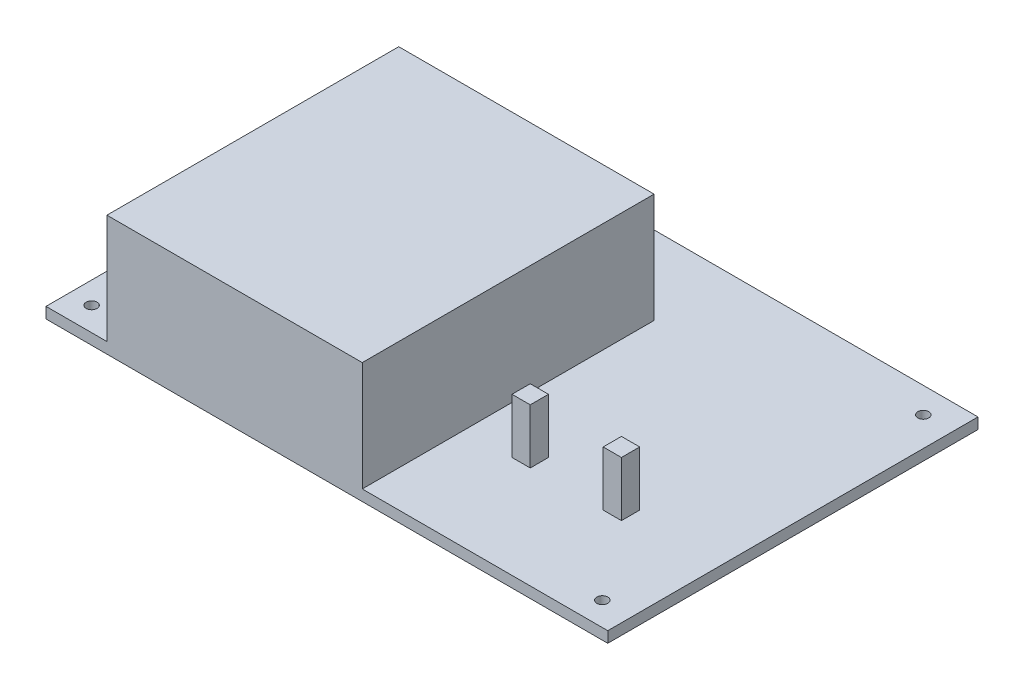
ISO-10303-21;
HEADER;
FILE_DESCRIPTION(('STEP AP214'),'2;1');
FILE_NAME('part.step','',(''),(''),'','','');
FILE_SCHEMA(('AUTOMOTIVE_DESIGN { 1 0 10303 214 1 1 1 1 }'));
ENDSEC;
DATA;
#1=APPLICATION_CONTEXT('core data for automotive mechanical design processes');
#2=APPLICATION_PROTOCOL_DEFINITION('international standard','automotive_design',2000,#1);
#3=PRODUCT_CONTEXT('',#1,'mechanical');
#4=PRODUCT('Part','Part','',(#3));
#5=PRODUCT_RELATED_PRODUCT_CATEGORY('part','',(#4));
#6=PRODUCT_DEFINITION_FORMATION('','',#4);
#7=PRODUCT_DEFINITION_CONTEXT('part definition',#1,'design');
#8=PRODUCT_DEFINITION('design','',#6,#7);
#9=PRODUCT_DEFINITION_SHAPE('','',#8);
#10=(LENGTH_UNIT() NAMED_UNIT(*) SI_UNIT(.MILLI.,.METRE.));
#11=(NAMED_UNIT(*) PLANE_ANGLE_UNIT() SI_UNIT($,.RADIAN.));
#12=(NAMED_UNIT(*) SI_UNIT($,.STERADIAN.) SOLID_ANGLE_UNIT());
#13=UNCERTAINTY_MEASURE_WITH_UNIT(LENGTH_MEASURE(1.E-05),#10,'distance_accuracy_value','');
#14=(GEOMETRIC_REPRESENTATION_CONTEXT(3) GLOBAL_UNCERTAINTY_ASSIGNED_CONTEXT((#13)) GLOBAL_UNIT_ASSIGNED_CONTEXT((#10,
#11,#12)) REPRESENTATION_CONTEXT('',''));
#15=CARTESIAN_POINT('',(0.,0.,0.));
#16=DIRECTION('',(0.,0.,1.));
#17=DIRECTION('',(1.,0.,0.));
#18=AXIS2_PLACEMENT_3D('',#15,#16,#17);
#19=CARTESIAN_POINT('',(0.,3.,0.));
#20=DIRECTION('',(0.,-1.,0.));
#21=DIRECTION('',(0.,0.,-1.));
#22=AXIS2_PLACEMENT_3D('',#19,#20,#21);
#23=PLANE('',#22);
#24=DIRECTION('',(0.,0.,-1.));
#25=VECTOR('',#24,1.);
#26=CARTESIAN_POINT('',(27.7499999999996,3.,22.7500000000001));
#27=LINE('',#26,#25);
#28=CARTESIAN_POINT('',(27.7499999999996,3.,22.7500000000001));
#29=VERTEX_POINT('',#28);
#30=CARTESIAN_POINT('',(27.7499999999996,3.,17.7500000000001));
#31=VERTEX_POINT('',#30);
#32=EDGE_CURVE('E169',#29,#31,#27,.T.);
#33=ORIENTED_EDGE('',*,*,#32,.F.);
#34=DIRECTION('',(1.,0.,0.));
#35=VECTOR('',#34,1.);
#36=CARTESIAN_POINT('',(22.7499999999996,3.,22.7500000000001));
#37=LINE('',#36,#35);
#38=CARTESIAN_POINT('',(22.7499999999996,3.,22.7500000000001));
#39=VERTEX_POINT('',#38);
#40=EDGE_CURVE('E182',#39,#29,#37,.T.);
#41=ORIENTED_EDGE('',*,*,#40,.F.);
#42=DIRECTION('',(0.,0.,1.));
#43=VECTOR('',#42,1.);
#44=CARTESIAN_POINT('',(22.7499999999996,3.,22.7500000000001));
#45=LINE('',#44,#43);
#46=CARTESIAN_POINT('',(22.7499999999996,3.,17.7500000000001));
#47=VERTEX_POINT('',#46);
#48=EDGE_CURVE('E191',#47,#39,#45,.T.);
#49=ORIENTED_EDGE('',*,*,#48,.F.);
#50=DIRECTION('',(-1.,0.,0.));
#51=VECTOR('',#50,1.);
#52=CARTESIAN_POINT('',(22.7499999999996,3.,17.7500000000001));
#53=LINE('',#52,#51);
#54=EDGE_CURVE('E172',#31,#47,#53,.T.);
#55=ORIENTED_EDGE('',*,*,#54,.F.);
#56=EDGE_LOOP('',(#33,#41,#49,#55));
#57=FACE_BOUND('',#56,.T.);
#58=CARTESIAN_POINT('',(-71.0000000000004,3.,-43.7499999999996));
#59=DIRECTION('',(0.,1.,0.));
#60=DIRECTION('',(0.,0.,1.));
#61=AXIS2_PLACEMENT_3D('',#58,#59,#60);
#62=CIRCLE('',#61,1.5);
#63=CARTESIAN_POINT('',(-71.0000000000004,3.,-42.2499999999996));
#64=VERTEX_POINT('',#63);
#65=EDGE_CURVE('E247',#64,#64,#62,.T.);
#66=ORIENTED_EDGE('',*,*,#65,.F.);
#67=EDGE_LOOP('',(#66));
#68=FACE_BOUND('',#67,.T.);
#69=CARTESIAN_POINT('',(68.9999999999996,3.,44.2500000000004));
#70=DIRECTION('',(0.,1.,0.));
#71=DIRECTION('',(0.,0.,1.));
#72=AXIS2_PLACEMENT_3D('',#69,#70,#71);
#73=CIRCLE('',#72,1.5);
#74=CARTESIAN_POINT('',(68.9999999999996,3.,45.7500000000004));
#75=VERTEX_POINT('',#74);
#76=EDGE_CURVE('E237',#75,#75,#73,.T.);
#77=ORIENTED_EDGE('',*,*,#76,.F.);
#78=EDGE_LOOP('',(#77));
#79=FACE_BOUND('',#78,.T.);
#80=CARTESIAN_POINT('',(-71.0000000000004,3.,44.2500000000004));
#81=DIRECTION('',(0.,1.,0.));
#82=DIRECTION('',(0.,0.,1.));
#83=AXIS2_PLACEMENT_3D('',#80,#81,#82);
#84=CIRCLE('',#83,1.5);
#85=CARTESIAN_POINT('',(-71.0000000000004,3.,45.7500000000004));
#86=VERTEX_POINT('',#85);
#87=EDGE_CURVE('E241',#86,#86,#84,.T.);
#88=ORIENTED_EDGE('',*,*,#87,.F.);
#89=EDGE_LOOP('',(#88));
#90=FACE_BOUND('',#89,.T.);
#91=CARTESIAN_POINT('',(68.9999999999996,3.,-43.7499999999996));
#92=DIRECTION('',(0.,1.,0.));
#93=DIRECTION('',(0.,0.,1.));
#94=AXIS2_PLACEMENT_3D('',#91,#92,#93);
#95=CIRCLE('',#94,1.5);
#96=CARTESIAN_POINT('',(68.9999999999996,3.,-42.2499999999996));
#97=VERTEX_POINT('',#96);
#98=EDGE_CURVE('E248',#97,#97,#95,.T.);
#99=ORIENTED_EDGE('',*,*,#98,.F.);
#100=EDGE_LOOP('',(#99));
#101=FACE_BOUND('',#100,.T.);
#102=DIRECTION('',(0.,0.,-1.));
#103=VECTOR('',#102,1.);
#104=CARTESIAN_POINT('',(9.69999999999963,3.,50.7500000000004));
#105=LINE('',#104,#103);
#106=CARTESIAN_POINT('',(9.69999999999963,3.,50.7500000000001));
#107=VERTEX_POINT('',#106);
#108=CARTESIAN_POINT('',(9.69999999999963,3.,-29.2499999999996));
#109=VERTEX_POINT('',#108);
#110=EDGE_CURVE('E207',#107,#109,#105,.T.);
#111=ORIENTED_EDGE('',*,*,#110,.F.);
#112=DIRECTION('',(1.,0.,0.));
#113=VECTOR('',#112,1.);
#114=CARTESIAN_POINT('',(-77.0000000000004,3.,50.7500000000001));
#115=LINE('',#114,#113);
#116=CARTESIAN_POINT('',(76.9999999999996,3.,50.7500000000001));
#117=VERTEX_POINT('',#116);
#118=EDGE_CURVE('E270',#107,#117,#115,.T.);
#119=ORIENTED_EDGE('',*,*,#118,.T.);
#120=DIRECTION('',(0.,0.,-1.));
#121=VECTOR('',#120,1.);
#122=CARTESIAN_POINT('',(76.9999999999996,3.,50.7500000000001));
#123=LINE('',#122,#121);
#124=CARTESIAN_POINT('',(76.9999999999996,3.,-50.7499999999996));
#125=VERTEX_POINT('',#124);
#126=EDGE_CURVE('E262',#117,#125,#123,.T.);
#127=ORIENTED_EDGE('',*,*,#126,.T.);
#128=DIRECTION('',(-1.,0.,0.));
#129=VECTOR('',#128,1.);
#130=CARTESIAN_POINT('',(-77.0000000000004,3.,-50.7499999999996));
#131=LINE('',#130,#129);
#132=CARTESIAN_POINT('',(-77.0000000000004,3.,-50.7499999999996));
#133=VERTEX_POINT('',#132);
#134=EDGE_CURVE('E265',#125,#133,#131,.T.);
#135=ORIENTED_EDGE('',*,*,#134,.T.);
#136=DIRECTION('',(0.,0.,1.));
#137=VECTOR('',#136,1.);
#138=CARTESIAN_POINT('',(-77.0000000000004,3.,50.7500000000001));
#139=LINE('',#138,#137);
#140=CARTESIAN_POINT('',(-77.0000000000004,3.,50.7500000000001));
#141=VERTEX_POINT('',#140);
#142=EDGE_CURVE('E268',#133,#141,#139,.T.);
#143=ORIENTED_EDGE('',*,*,#142,.T.);
#144=CARTESIAN_POINT('',(-60.3000000000004,3.,50.7500000000001));
#145=VERTEX_POINT('',#144);
#146=EDGE_CURVE('E271',#141,#145,#115,.T.);
#147=ORIENTED_EDGE('',*,*,#146,.T.);
#148=DIRECTION('',(0.,0.,1.));
#149=VECTOR('',#148,1.);
#150=CARTESIAN_POINT('',(-60.3000000000004,3.,50.7500000000004));
#151=LINE('',#150,#149);
#152=CARTESIAN_POINT('',(-60.3000000000004,3.,-29.2499999999996));
#153=VERTEX_POINT('',#152);
#154=EDGE_CURVE('E212',#153,#145,#151,.T.);
#155=ORIENTED_EDGE('',*,*,#154,.F.);
#156=DIRECTION('',(-1.,0.,0.));
#157=VECTOR('',#156,1.);
#158=CARTESIAN_POINT('',(-60.3000000000004,3.,-29.2499999999996));
#159=LINE('',#158,#157);
#160=EDGE_CURVE('E221',#109,#153,#159,.T.);
#161=ORIENTED_EDGE('',*,*,#160,.F.);
#162=EDGE_LOOP('',(#111,#119,#127,#135,#143,#147,#155,#161));
#163=FACE_BOUND('',#162,.T.);
#164=DIRECTION('',(0.,0.,-1.));
#165=VECTOR('',#164,1.);
#166=CARTESIAN_POINT('',(52.7499999999996,3.,22.7500000000001));
#167=LINE('',#166,#165);
#168=CARTESIAN_POINT('',(52.7499999999996,3.,22.7500000000001));
#169=VERTEX_POINT('',#168);
#170=CARTESIAN_POINT('',(52.7499999999996,3.,17.7500000000001));
#171=VERTEX_POINT('',#170);
#172=EDGE_CURVE('E168',#169,#171,#167,.T.);
#173=ORIENTED_EDGE('',*,*,#172,.F.);
#174=DIRECTION('',(1.,0.,0.));
#175=VECTOR('',#174,1.);
#176=CARTESIAN_POINT('',(47.7499999999996,3.,22.7500000000001));
#177=LINE('',#176,#175);
#178=CARTESIAN_POINT('',(47.7499999999996,3.,22.7500000000001));
#179=VERTEX_POINT('',#178);
#180=EDGE_CURVE('E165',#179,#169,#177,.T.);
#181=ORIENTED_EDGE('',*,*,#180,.F.);
#182=DIRECTION('',(0.,0.,1.));
#183=VECTOR('',#182,1.);
#184=CARTESIAN_POINT('',(47.7499999999996,3.,22.7500000000001));
#185=LINE('',#184,#183);
#186=CARTESIAN_POINT('',(47.7499999999996,3.,17.7500000000001));
#187=VERTEX_POINT('',#186);
#188=EDGE_CURVE('E55',#187,#179,#185,.T.);
#189=ORIENTED_EDGE('',*,*,#188,.F.);
#190=DIRECTION('',(-1.,0.,0.));
#191=VECTOR('',#190,1.);
#192=CARTESIAN_POINT('',(47.7499999999996,3.,17.7500000000001));
#193=LINE('',#192,#191);
#194=EDGE_CURVE('E50',#171,#187,#193,.T.);
#195=ORIENTED_EDGE('',*,*,#194,.F.);
#196=EDGE_LOOP('',(#173,#181,#189,#195));
#197=FACE_BOUND('',#196,.T.);
#198=ADVANCED_FACE('F35',(#57,#68,#79,#90,#101,#163,#197),#23,.F.);
#199=CARTESIAN_POINT('',(76.9999999999996,3.,50.7500000000001));
#200=DIRECTION('',(-1.,0.,0.));
#201=DIRECTION('',(0.,0.,1.));
#202=AXIS2_PLACEMENT_3D('',#199,#200,#201);
#203=PLANE('',#202);
#204=DIRECTION('',(0.,0.,-1.));
#205=VECTOR('',#204,1.);
#206=CARTESIAN_POINT('',(76.9999999999996,0.,50.7500000000001));
#207=LINE('',#206,#205);
#208=CARTESIAN_POINT('',(76.9999999999996,0.,50.7500000000001));
#209=VERTEX_POINT('',#208);
#210=CARTESIAN_POINT('',(76.9999999999996,0.,-50.7499999999996));
#211=VERTEX_POINT('',#210);
#212=EDGE_CURVE('E259',#209,#211,#207,.T.);
#213=ORIENTED_EDGE('',*,*,#212,.T.);
#214=DIRECTION('',(0.,-1.,0.));
#215=VECTOR('',#214,1.);
#216=CARTESIAN_POINT('',(76.9999999999996,3.,-50.7499999999996));
#217=LINE('',#216,#215);
#218=EDGE_CURVE('E11',#125,#211,#217,.T.);
#219=ORIENTED_EDGE('',*,*,#218,.F.);
#220=ORIENTED_EDGE('',*,*,#126,.F.);
#221=DIRECTION('',(0.,-1.,0.));
#222=VECTOR('',#221,1.);
#223=CARTESIAN_POINT('',(76.9999999999996,3.,50.7500000000001));
#224=LINE('',#223,#222);
#225=EDGE_CURVE('E273',#117,#209,#224,.T.);
#226=ORIENTED_EDGE('',*,*,#225,.T.);
#227=EDGE_LOOP('',(#213,#219,#220,#226));
#228=FACE_BOUND('',#227,.T.);
#229=ADVANCED_FACE('F37',(#228),#203,.F.);
#230=CARTESIAN_POINT('',(-77.0000000000004,3.,-50.7499999999996));
#231=DIRECTION('',(0.,0.,1.));
#232=DIRECTION('',(1.,0.,0.));
#233=AXIS2_PLACEMENT_3D('',#230,#231,#232);
#234=PLANE('',#233);
#235=DIRECTION('',(-1.,0.,0.));
#236=VECTOR('',#235,1.);
#237=CARTESIAN_POINT('',(-77.0000000000004,0.,-50.7499999999996));
#238=LINE('',#237,#236);
#239=CARTESIAN_POINT('',(-77.0000000000004,0.,-50.7499999999996));
#240=VERTEX_POINT('',#239);
#241=EDGE_CURVE('E276',#211,#240,#238,.T.);
#242=ORIENTED_EDGE('',*,*,#241,.T.);
#243=DIRECTION('',(0.,-1.,0.));
#244=VECTOR('',#243,1.);
#245=CARTESIAN_POINT('',(-77.0000000000004,3.,-50.7499999999996));
#246=LINE('',#245,#244);
#247=EDGE_CURVE('E43',#133,#240,#246,.T.);
#248=ORIENTED_EDGE('',*,*,#247,.F.);
#249=ORIENTED_EDGE('',*,*,#134,.F.);
#250=ORIENTED_EDGE('',*,*,#218,.T.);
#251=EDGE_LOOP('',(#242,#248,#249,#250));
#252=FACE_BOUND('',#251,.T.);
#253=ADVANCED_FACE('F336',(#252),#234,.F.);
#254=CARTESIAN_POINT('',(-77.0000000000004,3.,50.7500000000001));
#255=DIRECTION('',(1.,0.,0.));
#256=DIRECTION('',(0.,0.,-1.));
#257=AXIS2_PLACEMENT_3D('',#254,#255,#256);
#258=PLANE('',#257);
#259=DIRECTION('',(0.,0.,1.));
#260=VECTOR('',#259,1.);
#261=CARTESIAN_POINT('',(-77.0000000000004,0.,50.7500000000001));
#262=LINE('',#261,#260);
#263=CARTESIAN_POINT('',(-77.0000000000004,0.,50.7500000000001));
#264=VERTEX_POINT('',#263);
#265=EDGE_CURVE('E278',#240,#264,#262,.T.);
#266=ORIENTED_EDGE('',*,*,#265,.T.);
#267=DIRECTION('',(0.,-1.,0.));
#268=VECTOR('',#267,1.);
#269=CARTESIAN_POINT('',(-77.0000000000004,3.,50.7500000000001));
#270=LINE('',#269,#268);
#271=EDGE_CURVE('E283',#141,#264,#270,.T.);
#272=ORIENTED_EDGE('',*,*,#271,.F.);
#273=ORIENTED_EDGE('',*,*,#142,.F.);
#274=ORIENTED_EDGE('',*,*,#247,.T.);
#275=EDGE_LOOP('',(#266,#272,#273,#274));
#276=FACE_BOUND('',#275,.T.);
#277=ADVANCED_FACE('F290',(#276),#258,.F.);
#278=CARTESIAN_POINT('',(-77.0000000000004,3.,50.7500000000001));
#279=DIRECTION('',(0.,0.,-1.));
#280=DIRECTION('',(-1.,0.,0.));
#281=AXIS2_PLACEMENT_3D('',#278,#279,#280);
#282=PLANE('',#281);
#283=DIRECTION('',(1.,0.,0.));
#284=VECTOR('',#283,1.);
#285=CARTESIAN_POINT('',(-77.0000000000004,0.,50.7500000000001));
#286=LINE('',#285,#284);
#287=EDGE_CURVE('E266',#264,#209,#286,.T.);
#288=ORIENTED_EDGE('',*,*,#287,.T.);
#289=ORIENTED_EDGE('',*,*,#225,.F.);
#290=ORIENTED_EDGE('',*,*,#118,.F.);
#291=DIRECTION('',(0.,-1.,0.));
#292=VECTOR('',#291,1.);
#293=CARTESIAN_POINT('',(9.69999999999963,33.,50.7500000000004));
#294=LINE('',#293,#292);
#295=CARTESIAN_POINT('',(9.69999999999963,33.,50.7500000000004));
#296=VERTEX_POINT('',#295);
#297=EDGE_CURVE('E218',#296,#107,#294,.T.);
#298=ORIENTED_EDGE('',*,*,#297,.F.);
#299=DIRECTION('',(1.,0.,0.));
#300=VECTOR('',#299,1.);
#301=CARTESIAN_POINT('',(-60.3000000000004,33.,50.7500000000004));
#302=LINE('',#301,#300);
#303=CARTESIAN_POINT('',(-60.3000000000004,33.,50.7500000000004));
#304=VERTEX_POINT('',#303);
#305=EDGE_CURVE('E216',#304,#296,#302,.T.);
#306=ORIENTED_EDGE('',*,*,#305,.F.);
#307=DIRECTION('',(0.,-1.,0.));
#308=VECTOR('',#307,1.);
#309=CARTESIAN_POINT('',(-60.3000000000004,33.,50.7500000000004));
#310=LINE('',#309,#308);
#311=EDGE_CURVE('E228',#304,#145,#310,.T.);
#312=ORIENTED_EDGE('',*,*,#311,.T.);
#313=ORIENTED_EDGE('',*,*,#146,.F.);
#314=ORIENTED_EDGE('',*,*,#271,.T.);
#315=EDGE_LOOP('',(#288,#289,#290,#298,#306,#312,#313,#314));
#316=FACE_BOUND('',#315,.T.);
#317=ADVANCED_FACE('F299',(#316),#282,.F.);
#318=CARTESIAN_POINT('',(0.,0.,0.));
#319=DIRECTION('',(0.,-1.,0.));
#320=DIRECTION('',(0.,0.,-1.));
#321=AXIS2_PLACEMENT_3D('',#318,#319,#320);
#322=PLANE('',#321);
#323=CARTESIAN_POINT('',(-3.7470027081099E-13,0.,2.22044604925031E-13));
#324=DIRECTION('',(0.,-1.,0.));
#325=DIRECTION('',(0.,0.,-1.));
#326=AXIS2_PLACEMENT_3D('',#323,#324,#325);
#327=CIRCLE('',#326,5.);
#328=CARTESIAN_POINT('',(-3.7470027081099E-13,0.,-4.99999999999978));
#329=VERTEX_POINT('',#328);
#330=EDGE_CURVE('E572',#329,#329,#327,.T.);
#331=ORIENTED_EDGE('',*,*,#330,.F.);
#332=EDGE_LOOP('',(#331));
#333=FACE_BOUND('',#332,.T.);
#334=CARTESIAN_POINT('',(68.9999999999996,0.,-43.7499999999996));
#335=DIRECTION('',(0.,1.,0.));
#336=DIRECTION('',(0.,0.,1.));
#337=AXIS2_PLACEMENT_3D('',#334,#335,#336);
#338=CIRCLE('',#337,1.5);
#339=CARTESIAN_POINT('',(68.9999999999996,0.,-42.2499999999996));
#340=VERTEX_POINT('',#339);
#341=EDGE_CURVE('E244',#340,#340,#338,.T.);
#342=ORIENTED_EDGE('',*,*,#341,.T.);
#343=EDGE_LOOP('',(#342));
#344=FACE_BOUND('',#343,.T.);
#345=CARTESIAN_POINT('',(-71.0000000000004,0.,44.2500000000004));
#346=DIRECTION('',(0.,1.,0.));
#347=DIRECTION('',(0.,0.,1.));
#348=AXIS2_PLACEMENT_3D('',#345,#346,#347);
#349=CIRCLE('',#348,1.5);
#350=CARTESIAN_POINT('',(-71.0000000000004,0.,45.7500000000004));
#351=VERTEX_POINT('',#350);
#352=EDGE_CURVE('E251',#351,#351,#349,.T.);
#353=ORIENTED_EDGE('',*,*,#352,.T.);
#354=EDGE_LOOP('',(#353));
#355=FACE_BOUND('',#354,.T.);
#356=CARTESIAN_POINT('',(68.9999999999996,0.,44.2500000000004));
#357=DIRECTION('',(0.,1.,0.));
#358=DIRECTION('',(0.,0.,1.));
#359=AXIS2_PLACEMENT_3D('',#356,#357,#358);
#360=CIRCLE('',#359,1.5);
#361=CARTESIAN_POINT('',(68.9999999999996,0.,45.7500000000004));
#362=VERTEX_POINT('',#361);
#363=EDGE_CURVE('E238',#362,#362,#360,.T.);
#364=ORIENTED_EDGE('',*,*,#363,.T.);
#365=EDGE_LOOP('',(#364));
#366=FACE_BOUND('',#365,.T.);
#367=CARTESIAN_POINT('',(-71.0000000000004,0.,-43.7499999999996));
#368=DIRECTION('',(0.,1.,0.));
#369=DIRECTION('',(0.,0.,1.));
#370=AXIS2_PLACEMENT_3D('',#367,#368,#369);
#371=CIRCLE('',#370,1.5);
#372=CARTESIAN_POINT('',(-71.0000000000004,0.,-42.2499999999996));
#373=VERTEX_POINT('',#372);
#374=EDGE_CURVE('E256',#373,#373,#371,.T.);
#375=ORIENTED_EDGE('',*,*,#374,.T.);
#376=EDGE_LOOP('',(#375));
#377=FACE_BOUND('',#376,.T.);
#378=ORIENTED_EDGE('',*,*,#212,.F.);
#379=ORIENTED_EDGE('',*,*,#287,.F.);
#380=ORIENTED_EDGE('',*,*,#265,.F.);
#381=ORIENTED_EDGE('',*,*,#241,.F.);
#382=EDGE_LOOP('',(#378,#379,#380,#381));
#383=FACE_BOUND('',#382,.T.);
#384=ADVANCED_FACE('F296',(#333,#344,#355,#366,#377,#383),#322,.T.);
#385=CARTESIAN_POINT('',(-71.0000000000004,0.,-43.7499999999996));
#386=DIRECTION('',(0.,1.,0.));
#387=DIRECTION('',(0.,0.,1.));
#388=AXIS2_PLACEMENT_3D('',#385,#386,#387);
#389=CYLINDRICAL_SURFACE('',#388,1.5);
#390=ORIENTED_EDGE('',*,*,#374,.F.);
#391=EDGE_LOOP('',(#390));
#392=FACE_BOUND('',#391,.T.);
#393=ORIENTED_EDGE('',*,*,#65,.T.);
#394=EDGE_LOOP('',(#393));
#395=FACE_BOUND('',#394,.T.);
#396=ADVANCED_FACE('F340',(#392,#395),#389,.F.);
#397=CARTESIAN_POINT('',(68.9999999999996,0.,44.2500000000004));
#398=DIRECTION('',(0.,1.,0.));
#399=DIRECTION('',(0.,0.,1.));
#400=AXIS2_PLACEMENT_3D('',#397,#398,#399);
#401=CYLINDRICAL_SURFACE('',#400,1.5);
#402=ORIENTED_EDGE('',*,*,#363,.F.);
#403=EDGE_LOOP('',(#402));
#404=FACE_BOUND('',#403,.T.);
#405=ORIENTED_EDGE('',*,*,#76,.T.);
#406=EDGE_LOOP('',(#405));
#407=FACE_BOUND('',#406,.T.);
#408=ADVANCED_FACE('F379',(#404,#407),#401,.F.);
#409=CARTESIAN_POINT('',(-71.0000000000004,0.,44.2500000000004));
#410=DIRECTION('',(0.,1.,0.));
#411=DIRECTION('',(0.,0.,1.));
#412=AXIS2_PLACEMENT_3D('',#409,#410,#411);
#413=CYLINDRICAL_SURFACE('',#412,1.5);
#414=ORIENTED_EDGE('',*,*,#352,.F.);
#415=EDGE_LOOP('',(#414));
#416=FACE_BOUND('',#415,.T.);
#417=ORIENTED_EDGE('',*,*,#87,.T.);
#418=EDGE_LOOP('',(#417));
#419=FACE_BOUND('',#418,.T.);
#420=ADVANCED_FACE('F387',(#416,#419),#413,.F.);
#421=CARTESIAN_POINT('',(68.9999999999996,0.,-43.7499999999996));
#422=DIRECTION('',(0.,1.,0.));
#423=DIRECTION('',(0.,0.,1.));
#424=AXIS2_PLACEMENT_3D('',#421,#422,#423);
#425=CYLINDRICAL_SURFACE('',#424,1.5);
#426=ORIENTED_EDGE('',*,*,#341,.F.);
#427=EDGE_LOOP('',(#426));
#428=FACE_BOUND('',#427,.T.);
#429=ORIENTED_EDGE('',*,*,#98,.T.);
#430=EDGE_LOOP('',(#429));
#431=FACE_BOUND('',#430,.T.);
#432=ADVANCED_FACE('F328',(#428,#431),#425,.F.);
#433=CARTESIAN_POINT('',(9.69999999999963,33.,50.7500000000004));
#434=DIRECTION('',(-1.,0.,0.));
#435=DIRECTION('',(0.,0.,1.));
#436=AXIS2_PLACEMENT_3D('',#433,#434,#435);
#437=PLANE('',#436);
#438=ORIENTED_EDGE('',*,*,#110,.T.);
#439=DIRECTION('',(0.,-1.,0.));
#440=VECTOR('',#439,1.);
#441=CARTESIAN_POINT('',(9.69999999999963,33.,-29.2499999999996));
#442=LINE('',#441,#440);
#443=CARTESIAN_POINT('',(9.69999999999963,33.,-29.2499999999996));
#444=VERTEX_POINT('',#443);
#445=EDGE_CURVE('E234',#444,#109,#442,.T.);
#446=ORIENTED_EDGE('',*,*,#445,.F.);
#447=DIRECTION('',(0.,0.,-1.));
#448=VECTOR('',#447,1.);
#449=CARTESIAN_POINT('',(9.69999999999963,33.,50.7500000000004));
#450=LINE('',#449,#448);
#451=EDGE_CURVE('E208',#296,#444,#450,.T.);
#452=ORIENTED_EDGE('',*,*,#451,.F.);
#453=ORIENTED_EDGE('',*,*,#297,.T.);
#454=EDGE_LOOP('',(#438,#446,#452,#453));
#455=FACE_BOUND('',#454,.T.);
#456=ADVANCED_FACE('F310',(#455),#437,.F.);
#457=CARTESIAN_POINT('',(-60.3000000000004,33.,-29.2499999999996));
#458=DIRECTION('',(0.,0.,1.));
#459=DIRECTION('',(1.,0.,0.));
#460=AXIS2_PLACEMENT_3D('',#457,#458,#459);
#461=PLANE('',#460);
#462=ORIENTED_EDGE('',*,*,#160,.T.);
#463=DIRECTION('',(0.,-1.,0.));
#464=VECTOR('',#463,1.);
#465=CARTESIAN_POINT('',(-60.3000000000004,33.,-29.2499999999996));
#466=LINE('',#465,#464);
#467=CARTESIAN_POINT('',(-60.3000000000004,33.,-29.2499999999996));
#468=VERTEX_POINT('',#467);
#469=EDGE_CURVE('E231',#468,#153,#466,.T.);
#470=ORIENTED_EDGE('',*,*,#469,.F.);
#471=DIRECTION('',(-1.,0.,0.));
#472=VECTOR('',#471,1.);
#473=CARTESIAN_POINT('',(-60.3000000000004,33.,-29.2499999999996));
#474=LINE('',#473,#472);
#475=EDGE_CURVE('E211',#444,#468,#474,.T.);
#476=ORIENTED_EDGE('',*,*,#475,.F.);
#477=ORIENTED_EDGE('',*,*,#445,.T.);
#478=EDGE_LOOP('',(#462,#470,#476,#477));
#479=FACE_BOUND('',#478,.T.);
#480=ADVANCED_FACE('F320',(#479),#461,.F.);
#481=CARTESIAN_POINT('',(-60.3000000000004,33.,50.7500000000004));
#482=DIRECTION('',(1.,0.,0.));
#483=DIRECTION('',(0.,0.,-1.));
#484=AXIS2_PLACEMENT_3D('',#481,#482,#483);
#485=PLANE('',#484);
#486=ORIENTED_EDGE('',*,*,#154,.T.);
#487=ORIENTED_EDGE('',*,*,#311,.F.);
#488=DIRECTION('',(0.,0.,1.));
#489=VECTOR('',#488,1.);
#490=CARTESIAN_POINT('',(-60.3000000000004,33.,50.7500000000004));
#491=LINE('',#490,#489);
#492=EDGE_CURVE('E214',#468,#304,#491,.T.);
#493=ORIENTED_EDGE('',*,*,#492,.F.);
#494=ORIENTED_EDGE('',*,*,#469,.T.);
#495=EDGE_LOOP('',(#486,#487,#493,#494));
#496=FACE_BOUND('',#495,.T.);
#497=ADVANCED_FACE('F318',(#496),#485,.F.);
#498=CARTESIAN_POINT('',(0.,33.,0.));
#499=DIRECTION('',(0.,-1.,0.));
#500=DIRECTION('',(0.,0.,-1.));
#501=AXIS2_PLACEMENT_3D('',#498,#499,#500);
#502=PLANE('',#501);
#503=ORIENTED_EDGE('',*,*,#451,.T.);
#504=ORIENTED_EDGE('',*,*,#475,.T.);
#505=ORIENTED_EDGE('',*,*,#492,.T.);
#506=ORIENTED_EDGE('',*,*,#305,.T.);
#507=EDGE_LOOP('',(#503,#504,#505,#506));
#508=FACE_BOUND('',#507,.T.);
#509=ADVANCED_FACE('F313',(#508),#502,.F.);
#510=CARTESIAN_POINT('',(27.7499999999996,18.,22.7500000000001));
#511=DIRECTION('',(-1.,0.,0.));
#512=DIRECTION('',(0.,0.,1.));
#513=AXIS2_PLACEMENT_3D('',#510,#511,#512);
#514=PLANE('',#513);
#515=ORIENTED_EDGE('',*,*,#32,.T.);
#516=DIRECTION('',(0.,-1.,0.));
#517=VECTOR('',#516,1.);
#518=CARTESIAN_POINT('',(27.7499999999996,18.,17.7500000000001));
#519=LINE('',#518,#517);
#520=CARTESIAN_POINT('',(27.7499999999996,18.,17.7500000000001));
#521=VERTEX_POINT('',#520);
#522=EDGE_CURVE('E204',#521,#31,#519,.T.);
#523=ORIENTED_EDGE('',*,*,#522,.F.);
#524=DIRECTION('',(0.,0.,-1.));
#525=VECTOR('',#524,1.);
#526=CARTESIAN_POINT('',(27.7499999999996,18.,22.7500000000001));
#527=LINE('',#526,#525);
#528=CARTESIAN_POINT('',(27.7499999999996,18.,22.7500000000001));
#529=VERTEX_POINT('',#528);
#530=EDGE_CURVE('E178',#529,#521,#527,.T.);
#531=ORIENTED_EDGE('',*,*,#530,.F.);
#532=DIRECTION('',(0.,-1.,0.));
#533=VECTOR('',#532,1.);
#534=CARTESIAN_POINT('',(27.7499999999996,18.,22.7500000000001));
#535=LINE('',#534,#533);
#536=EDGE_CURVE('E187',#529,#29,#535,.T.);
#537=ORIENTED_EDGE('',*,*,#536,.T.);
#538=EDGE_LOOP('',(#515,#523,#531,#537));
#539=FACE_BOUND('',#538,.T.);
#540=ADVANCED_FACE('F425',(#539),#514,.F.);
#541=CARTESIAN_POINT('',(22.7499999999996,18.,17.7500000000001));
#542=DIRECTION('',(0.,0.,1.));
#543=DIRECTION('',(1.,0.,0.));
#544=AXIS2_PLACEMENT_3D('',#541,#542,#543);
#545=PLANE('',#544);
#546=ORIENTED_EDGE('',*,*,#54,.T.);
#547=DIRECTION('',(0.,-1.,0.));
#548=VECTOR('',#547,1.);
#549=CARTESIAN_POINT('',(22.7499999999996,18.,17.7500000000001));
#550=LINE('',#549,#548);
#551=CARTESIAN_POINT('',(22.7499999999996,18.,17.7500000000001));
#552=VERTEX_POINT('',#551);
#553=EDGE_CURVE('E201',#552,#47,#550,.T.);
#554=ORIENTED_EDGE('',*,*,#553,.F.);
#555=DIRECTION('',(-1.,0.,0.));
#556=VECTOR('',#555,1.);
#557=CARTESIAN_POINT('',(22.7499999999996,18.,17.7500000000001));
#558=LINE('',#557,#556);
#559=EDGE_CURVE('E181',#521,#552,#558,.T.);
#560=ORIENTED_EDGE('',*,*,#559,.F.);
#561=ORIENTED_EDGE('',*,*,#522,.T.);
#562=EDGE_LOOP('',(#546,#554,#560,#561));
#563=FACE_BOUND('',#562,.T.);
#564=ADVANCED_FACE('F411',(#563),#545,.F.);
#565=CARTESIAN_POINT('',(22.7499999999996,18.,22.7500000000001));
#566=DIRECTION('',(1.,0.,0.));
#567=DIRECTION('',(0.,0.,-1.));
#568=AXIS2_PLACEMENT_3D('',#565,#566,#567);
#569=PLANE('',#568);
#570=ORIENTED_EDGE('',*,*,#48,.T.);
#571=DIRECTION('',(0.,-1.,0.));
#572=VECTOR('',#571,1.);
#573=CARTESIAN_POINT('',(22.7499999999996,18.,22.7500000000001));
#574=LINE('',#573,#572);
#575=CARTESIAN_POINT('',(22.7499999999996,18.,22.7500000000001));
#576=VERTEX_POINT('',#575);
#577=EDGE_CURVE('E198',#576,#39,#574,.T.);
#578=ORIENTED_EDGE('',*,*,#577,.F.);
#579=DIRECTION('',(0.,0.,1.));
#580=VECTOR('',#579,1.);
#581=CARTESIAN_POINT('',(22.7499999999996,18.,22.7500000000001));
#582=LINE('',#581,#580);
#583=EDGE_CURVE('E184',#552,#576,#582,.T.);
#584=ORIENTED_EDGE('',*,*,#583,.F.);
#585=ORIENTED_EDGE('',*,*,#553,.T.);
#586=EDGE_LOOP('',(#570,#578,#584,#585));
#587=FACE_BOUND('',#586,.T.);
#588=ADVANCED_FACE('F459',(#587),#569,.F.);
#589=CARTESIAN_POINT('',(22.7499999999996,18.,22.7500000000001));
#590=DIRECTION('',(0.,0.,-1.));
#591=DIRECTION('',(-1.,0.,0.));
#592=AXIS2_PLACEMENT_3D('',#589,#590,#591);
#593=PLANE('',#592);
#594=ORIENTED_EDGE('',*,*,#40,.T.);
#595=ORIENTED_EDGE('',*,*,#536,.F.);
#596=DIRECTION('',(1.,0.,0.));
#597=VECTOR('',#596,1.);
#598=CARTESIAN_POINT('',(22.7499999999996,18.,22.7500000000001));
#599=LINE('',#598,#597);
#600=EDGE_CURVE('E186',#576,#529,#599,.T.);
#601=ORIENTED_EDGE('',*,*,#600,.F.);
#602=ORIENTED_EDGE('',*,*,#577,.T.);
#603=EDGE_LOOP('',(#594,#595,#601,#602));
#604=FACE_BOUND('',#603,.T.);
#605=ADVANCED_FACE('F468',(#604),#593,.F.);
#606=CARTESIAN_POINT('',(0.,18.,0.));
#607=DIRECTION('',(0.,-1.,0.));
#608=DIRECTION('',(0.,0.,-1.));
#609=AXIS2_PLACEMENT_3D('',#606,#607,#608);
#610=PLANE('',#609);
#611=ORIENTED_EDGE('',*,*,#530,.T.);
#612=ORIENTED_EDGE('',*,*,#559,.T.);
#613=ORIENTED_EDGE('',*,*,#583,.T.);
#614=ORIENTED_EDGE('',*,*,#600,.T.);
#615=EDGE_LOOP('',(#611,#612,#613,#614));
#616=FACE_BOUND('',#615,.T.);
#617=ADVANCED_FACE('F477',(#616),#610,.F.);
#618=CARTESIAN_POINT('',(52.7499999999996,18.,22.7500000000001));
#619=DIRECTION('',(-1.,0.,0.));
#620=DIRECTION('',(0.,0.,1.));
#621=AXIS2_PLACEMENT_3D('',#618,#619,#620);
#622=PLANE('',#621);
#623=ORIENTED_EDGE('',*,*,#172,.T.);
#624=DIRECTION('',(0.,-1.,0.));
#625=VECTOR('',#624,1.);
#626=CARTESIAN_POINT('',(52.7499999999996,18.,17.7500000000001));
#627=LINE('',#626,#625);
#628=CARTESIAN_POINT('',(52.7499999999996,18.,17.7500000000001));
#629=VERTEX_POINT('',#628);
#630=EDGE_CURVE('E149',#629,#171,#627,.T.);
#631=ORIENTED_EDGE('',*,*,#630,.F.);
#632=DIRECTION('',(0.,0.,-1.));
#633=VECTOR('',#632,1.);
#634=CARTESIAN_POINT('',(52.7499999999996,18.,22.7500000000001));
#635=LINE('',#634,#633);
#636=CARTESIAN_POINT('',(52.7499999999996,18.,22.7500000000001));
#637=VERTEX_POINT('',#636);
#638=EDGE_CURVE('E156',#637,#629,#635,.T.);
#639=ORIENTED_EDGE('',*,*,#638,.F.);
#640=DIRECTION('',(0.,-1.,0.));
#641=VECTOR('',#640,1.);
#642=CARTESIAN_POINT('',(52.7499999999996,18.,22.7500000000001));
#643=LINE('',#642,#641);
#644=EDGE_CURVE('E579',#637,#169,#643,.T.);
#645=ORIENTED_EDGE('',*,*,#644,.T.);
#646=EDGE_LOOP('',(#623,#631,#639,#645));
#647=FACE_BOUND('',#646,.T.);
#648=ADVANCED_FACE('F167',(#647),#622,.F.);
#649=CARTESIAN_POINT('',(47.7499999999996,18.,17.7500000000001));
#650=DIRECTION('',(0.,0.,1.));
#651=DIRECTION('',(1.,0.,0.));
#652=AXIS2_PLACEMENT_3D('',#649,#650,#651);
#653=PLANE('',#652);
#654=ORIENTED_EDGE('',*,*,#194,.T.);
#655=DIRECTION('',(0.,-1.,0.));
#656=VECTOR('',#655,1.);
#657=CARTESIAN_POINT('',(47.7499999999996,18.,17.7500000000001));
#658=LINE('',#657,#656);
#659=CARTESIAN_POINT('',(47.7499999999996,18.,17.7500000000001));
#660=VERTEX_POINT('',#659);
#661=EDGE_CURVE('E152',#660,#187,#658,.T.);
#662=ORIENTED_EDGE('',*,*,#661,.F.);
#663=DIRECTION('',(-1.,0.,0.));
#664=VECTOR('',#663,1.);
#665=CARTESIAN_POINT('',(47.7499999999996,18.,17.7500000000001));
#666=LINE('',#665,#664);
#667=EDGE_CURVE('E145',#629,#660,#666,.T.);
#668=ORIENTED_EDGE('',*,*,#667,.F.);
#669=ORIENTED_EDGE('',*,*,#630,.T.);
#670=EDGE_LOOP('',(#654,#662,#668,#669));
#671=FACE_BOUND('',#670,.T.);
#672=ADVANCED_FACE('F147',(#671),#653,.F.);
#673=CARTESIAN_POINT('',(47.7499999999996,18.,22.7500000000001));
#674=DIRECTION('',(1.,0.,0.));
#675=DIRECTION('',(0.,0.,-1.));
#676=AXIS2_PLACEMENT_3D('',#673,#674,#675);
#677=PLANE('',#676);
#678=ORIENTED_EDGE('',*,*,#188,.T.);
#679=DIRECTION('',(0.,-1.,0.));
#680=VECTOR('',#679,1.);
#681=CARTESIAN_POINT('',(47.7499999999996,18.,22.7500000000001));
#682=LINE('',#681,#680);
#683=CARTESIAN_POINT('',(47.7499999999996,18.,22.7500000000001));
#684=VERTEX_POINT('',#683);
#685=EDGE_CURVE('E174',#684,#179,#682,.T.);
#686=ORIENTED_EDGE('',*,*,#685,.F.);
#687=DIRECTION('',(0.,0.,1.));
#688=VECTOR('',#687,1.);
#689=CARTESIAN_POINT('',(47.7499999999996,18.,22.7500000000001));
#690=LINE('',#689,#688);
#691=EDGE_CURVE('E155',#660,#684,#690,.T.);
#692=ORIENTED_EDGE('',*,*,#691,.F.);
#693=ORIENTED_EDGE('',*,*,#661,.T.);
#694=EDGE_LOOP('',(#678,#686,#692,#693));
#695=FACE_BOUND('',#694,.T.);
#696=ADVANCED_FACE('F504',(#695),#677,.F.);
#697=CARTESIAN_POINT('',(47.7499999999996,18.,22.7500000000001));
#698=DIRECTION('',(0.,0.,-1.));
#699=DIRECTION('',(-1.,0.,0.));
#700=AXIS2_PLACEMENT_3D('',#697,#698,#699);
#701=PLANE('',#700);
#702=ORIENTED_EDGE('',*,*,#180,.T.);
#703=ORIENTED_EDGE('',*,*,#644,.F.);
#704=DIRECTION('',(1.,0.,0.));
#705=VECTOR('',#704,1.);
#706=CARTESIAN_POINT('',(47.7499999999996,18.,22.7500000000001));
#707=LINE('',#706,#705);
#708=EDGE_CURVE('E161',#684,#637,#707,.T.);
#709=ORIENTED_EDGE('',*,*,#708,.F.);
#710=ORIENTED_EDGE('',*,*,#685,.T.);
#711=EDGE_LOOP('',(#702,#703,#709,#710));
#712=FACE_BOUND('',#711,.T.);
#713=ADVANCED_FACE('F513',(#712),#701,.F.);
#714=CARTESIAN_POINT('',(0.,18.,0.));
#715=DIRECTION('',(0.,-1.,0.));
#716=DIRECTION('',(0.,0.,-1.));
#717=AXIS2_PLACEMENT_3D('',#714,#715,#716);
#718=PLANE('',#717);
#719=ORIENTED_EDGE('',*,*,#638,.T.);
#720=ORIENTED_EDGE('',*,*,#667,.T.);
#721=ORIENTED_EDGE('',*,*,#691,.T.);
#722=ORIENTED_EDGE('',*,*,#708,.T.);
#723=EDGE_LOOP('',(#719,#720,#721,#722));
#724=FACE_BOUND('',#723,.T.);
#725=ADVANCED_FACE('F159',(#724),#718,.F.);
#726=CARTESIAN_POINT('',(-3.7470027081099E-13,1.,2.22044604925031E-13));
#727=DIRECTION('',(0.,-1.,0.));
#728=DIRECTION('',(0.,0.,-1.));
#729=AXIS2_PLACEMENT_3D('',#726,#727,#728);
#730=CYLINDRICAL_SURFACE('',#729,5.);
#731=CARTESIAN_POINT('',(-3.7470027081099E-13,1.,2.22044604925031E-13));
#732=DIRECTION('',(0.,-1.,0.));
#733=DIRECTION('',(0.,0.,-1.));
#734=AXIS2_PLACEMENT_3D('',#731,#732,#733);
#735=CIRCLE('',#734,5.);
#736=CARTESIAN_POINT('',(-3.7470027081099E-13,1.,-4.99999999999978));
#737=VERTEX_POINT('',#736);
#738=EDGE_CURVE('E571',#737,#737,#735,.T.);
#739=ORIENTED_EDGE('',*,*,#738,.F.);
#740=EDGE_LOOP('',(#739));
#741=FACE_BOUND('',#740,.T.);
#742=ORIENTED_EDGE('',*,*,#330,.T.);
#743=EDGE_LOOP('',(#742));
#744=FACE_BOUND('',#743,.T.);
#745=ADVANCED_FACE('F530',(#741,#744),#730,.F.);
#746=CARTESIAN_POINT('',(-3.7470027081099E-13,1.,2.22044604925031E-13));
#747=DIRECTION('',(0.,-1.,0.));
#748=DIRECTION('',(0.,0.,-1.));
#749=AXIS2_PLACEMENT_3D('',#746,#747,#748);
#750=PLANE('',#749);
#751=ORIENTED_EDGE('',*,*,#738,.T.);
#752=EDGE_LOOP('',(#751));
#753=FACE_BOUND('',#752,.T.);
#754=ADVANCED_FACE('F538',(#753),#750,.T.);
#755=CLOSED_SHELL('',(#198,#229,#253,#277,#317,#384,#396,#408,#420,#432,#456,#480,#497,#509,
#540,#564,#588,#605,#617,#648,#672,#696,#713,#725,#745,#754));
#756=MANIFOLD_SOLID_BREP('B2',#755);
#757=ADVANCED_BREP_SHAPE_REPRESENTATION('',(#18,#756),#14);
#758=SHAPE_DEFINITION_REPRESENTATION(#9,#757);
ENDSEC;
END-ISO-10303-21;
